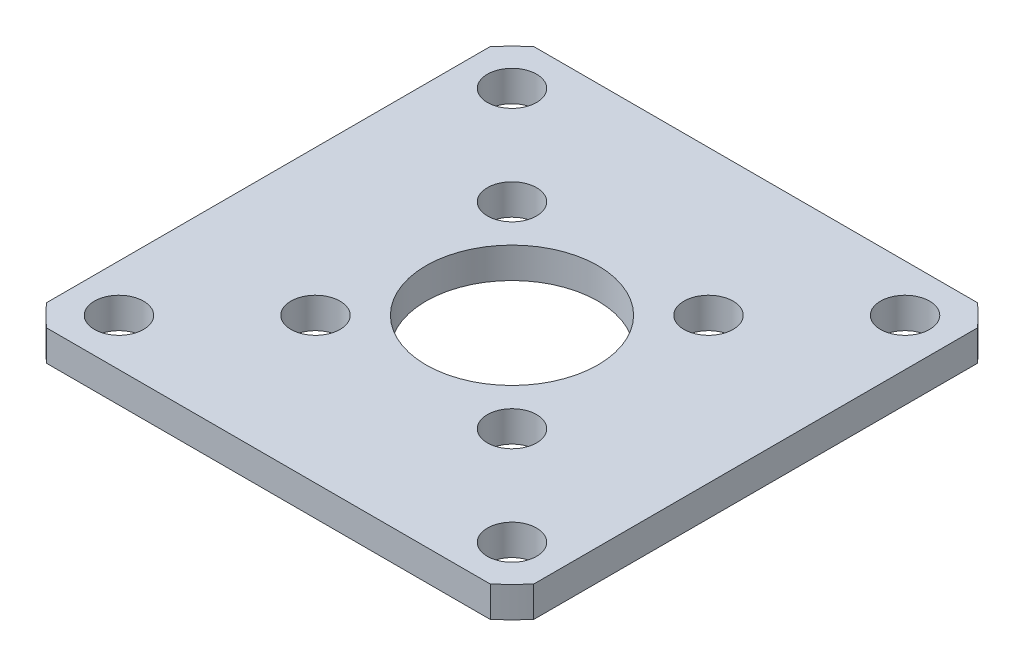
ISO-10303-21;
HEADER;
FILE_DESCRIPTION(('STEP AP214'),'2;1');
FILE_NAME('part.step','',(''),(''),'','','');
FILE_SCHEMA(('AUTOMOTIVE_DESIGN { 1 0 10303 214 1 1 1 1 }'));
ENDSEC;
DATA;
#1=APPLICATION_CONTEXT('core data for automotive mechanical design processes');
#2=APPLICATION_PROTOCOL_DEFINITION('international standard','automotive_design',2000,#1);
#3=PRODUCT_CONTEXT('',#1,'mechanical');
#4=PRODUCT('Part','Part','',(#3));
#5=PRODUCT_RELATED_PRODUCT_CATEGORY('part','',(#4));
#6=PRODUCT_DEFINITION_FORMATION('','',#4);
#7=PRODUCT_DEFINITION_CONTEXT('part definition',#1,'design');
#8=PRODUCT_DEFINITION('design','',#6,#7);
#9=PRODUCT_DEFINITION_SHAPE('','',#8);
#10=(LENGTH_UNIT() NAMED_UNIT(*) SI_UNIT(.MILLI.,.METRE.));
#11=(NAMED_UNIT(*) PLANE_ANGLE_UNIT() SI_UNIT($,.RADIAN.));
#12=(NAMED_UNIT(*) SI_UNIT($,.STERADIAN.) SOLID_ANGLE_UNIT());
#13=UNCERTAINTY_MEASURE_WITH_UNIT(LENGTH_MEASURE(1.E-05),#10,'distance_accuracy_value','');
#14=(GEOMETRIC_REPRESENTATION_CONTEXT(3) GLOBAL_UNCERTAINTY_ASSIGNED_CONTEXT((#13)) GLOBAL_UNIT_ASSIGNED_CONTEXT((#10,
#11,#12)) REPRESENTATION_CONTEXT('',''));
#15=CARTESIAN_POINT('',(0.,0.,0.));
#16=DIRECTION('',(0.,0.,1.));
#17=DIRECTION('',(1.,0.,0.));
#18=AXIS2_PLACEMENT_3D('',#15,#16,#17);
#19=CARTESIAN_POINT('',(0.,2.5,0.));
#20=DIRECTION('',(0.,-1.,0.));
#21=DIRECTION('',(0.,0.,-1.));
#22=AXIS2_PLACEMENT_3D('',#19,#20,#21);
#23=CYLINDRICAL_SURFACE('',#22,26.83);
#24=CARTESIAN_POINT('',(0.,2.5,0.));
#25=DIRECTION('',(0.,1.,0.));
#26=DIRECTION('',(0.,0.,1.));
#27=AXIS2_PLACEMENT_3D('',#24,#25,#26);
#28=CIRCLE('',#27,26.83);
#29=CARTESIAN_POINT('',(-19.8339359945665,2.5,18.0683115692485));
#30=VERTEX_POINT('',#29);
#31=CARTESIAN_POINT('',(-18.0683115692485,2.5,19.8339359945665));
#32=VERTEX_POINT('',#31);
#33=EDGE_CURVE('E117',#30,#32,#28,.T.);
#34=ORIENTED_EDGE('',*,*,#33,.F.);
#35=DIRECTION('',(0.,1.,0.));
#36=VECTOR('',#35,1.);
#37=CARTESIAN_POINT('',(-19.8339359945665,-7.5,18.0683115692485));
#38=LINE('',#37,#36);
#39=CARTESIAN_POINT('',(-19.8339359945665,0.,18.0683115692485));
#40=VERTEX_POINT('',#39);
#41=EDGE_CURVE('E101',#40,#30,#38,.T.);
#42=ORIENTED_EDGE('',*,*,#41,.F.);
#43=CARTESIAN_POINT('',(0.,0.,0.));
#44=DIRECTION('',(0.,1.,0.));
#45=DIRECTION('',(0.,0.,1.));
#46=AXIS2_PLACEMENT_3D('',#43,#44,#45);
#47=CIRCLE('',#46,26.83);
#48=CARTESIAN_POINT('',(-18.0683115692485,0.,19.8339359945665));
#49=VERTEX_POINT('',#48);
#50=EDGE_CURVE('E233',#40,#49,#47,.T.);
#51=ORIENTED_EDGE('',*,*,#50,.T.);
#52=DIRECTION('',(0.,1.,0.));
#53=VECTOR('',#52,1.);
#54=CARTESIAN_POINT('',(-18.0683115692485,-7.5,19.8339359945665));
#55=LINE('',#54,#53);
#56=EDGE_CURVE('E54',#49,#32,#55,.T.);
#57=ORIENTED_EDGE('',*,*,#56,.T.);
#58=EDGE_LOOP('',(#34,#42,#51,#57));
#59=FACE_BOUND('',#58,.T.);
#60=ADVANCED_FACE('F38',(#59),#23,.T.);
#61=CARTESIAN_POINT('',(-18.0683115692485,0.,-19.8339359945665));
#62=VERTEX_POINT('',#61);
#63=CARTESIAN_POINT('',(-19.8339359945665,0.,-18.0683115692485));
#64=VERTEX_POINT('',#63);
#65=EDGE_CURVE('E238',#62,#64,#47,.T.);
#66=ORIENTED_EDGE('',*,*,#65,.T.);
#67=DIRECTION('',(0.,1.,0.));
#68=VECTOR('',#67,1.);
#69=CARTESIAN_POINT('',(-19.8339359945665,-7.5,-18.0683115692485));
#70=LINE('',#69,#68);
#71=CARTESIAN_POINT('',(-19.8339359945665,2.5,-18.0683115692485));
#72=VERTEX_POINT('',#71);
#73=EDGE_CURVE('E62',#64,#72,#70,.T.);
#74=ORIENTED_EDGE('',*,*,#73,.T.);
#75=CARTESIAN_POINT('',(-18.0683115692485,2.5,-19.8339359945665));
#76=VERTEX_POINT('',#75);
#77=EDGE_CURVE('E120',#76,#72,#28,.T.);
#78=ORIENTED_EDGE('',*,*,#77,.F.);
#79=DIRECTION('',(0.,1.,0.));
#80=VECTOR('',#79,1.);
#81=CARTESIAN_POINT('',(-18.0683115692485,-7.5,-19.8339359945665));
#82=LINE('',#81,#80);
#83=EDGE_CURVE('E159',#62,#76,#82,.T.);
#84=ORIENTED_EDGE('',*,*,#83,.F.);
#85=EDGE_LOOP('',(#66,#74,#78,#84));
#86=FACE_BOUND('',#85,.T.);
#87=ADVANCED_FACE('F272',(#86),#23,.T.);
#88=DIRECTION('',(0.,1.,0.));
#89=VECTOR('',#88,1.);
#90=CARTESIAN_POINT('',(19.8339359945665,-7.5,18.0683115692485));
#91=LINE('',#90,#89);
#92=CARTESIAN_POINT('',(19.8339359945665,0.,18.0683115692485));
#93=VERTEX_POINT('',#92);
#94=CARTESIAN_POINT('',(19.8339359945665,2.5,18.0683115692485));
#95=VERTEX_POINT('',#94);
#96=EDGE_CURVE('E167',#93,#95,#91,.T.);
#97=ORIENTED_EDGE('',*,*,#96,.T.);
#98=CARTESIAN_POINT('',(18.0683115692485,2.5,19.8339359945665));
#99=VERTEX_POINT('',#98);
#100=EDGE_CURVE('E127',#99,#95,#28,.T.);
#101=ORIENTED_EDGE('',*,*,#100,.F.);
#102=DIRECTION('',(0.,1.,0.));
#103=VECTOR('',#102,1.);
#104=CARTESIAN_POINT('',(18.0683115692485,-7.5,19.8339359945665));
#105=LINE('',#104,#103);
#106=CARTESIAN_POINT('',(18.0683115692485,0.,19.8339359945665));
#107=VERTEX_POINT('',#106);
#108=EDGE_CURVE('E168',#107,#99,#105,.T.);
#109=ORIENTED_EDGE('',*,*,#108,.F.);
#110=EDGE_CURVE('E203',#107,#93,#47,.T.);
#111=ORIENTED_EDGE('',*,*,#110,.T.);
#112=EDGE_LOOP('',(#97,#101,#109,#111));
#113=FACE_BOUND('',#112,.T.);
#114=ADVANCED_FACE('F304',(#113),#23,.T.);
#115=CARTESIAN_POINT('',(19.8339359945665,0.,-18.0683115692485));
#116=VERTEX_POINT('',#115);
#117=CARTESIAN_POINT('',(18.0683115692485,0.,-19.8339359945665));
#118=VERTEX_POINT('',#117);
#119=EDGE_CURVE('E155',#116,#118,#47,.T.);
#120=ORIENTED_EDGE('',*,*,#119,.T.);
#121=DIRECTION('',(0.,1.,0.));
#122=VECTOR('',#121,1.);
#123=CARTESIAN_POINT('',(18.0683115692485,-7.5,-19.8339359945665));
#124=LINE('',#123,#122);
#125=CARTESIAN_POINT('',(18.0683115692485,2.5,-19.8339359945665));
#126=VERTEX_POINT('',#125);
#127=EDGE_CURVE('E122',#118,#126,#124,.T.);
#128=ORIENTED_EDGE('',*,*,#127,.T.);
#129=CARTESIAN_POINT('',(19.8339359945665,2.5,-18.0683115692485));
#130=VERTEX_POINT('',#129);
#131=EDGE_CURVE('E130',#130,#126,#28,.T.);
#132=ORIENTED_EDGE('',*,*,#131,.F.);
#133=DIRECTION('',(0.,1.,0.));
#134=VECTOR('',#133,1.);
#135=CARTESIAN_POINT('',(19.8339359945665,-7.5,-18.0683115692485));
#136=LINE('',#135,#134);
#137=EDGE_CURVE('E153',#116,#130,#136,.T.);
#138=ORIENTED_EDGE('',*,*,#137,.F.);
#139=EDGE_LOOP('',(#120,#128,#132,#138));
#140=FACE_BOUND('',#139,.T.);
#141=ADVANCED_FACE('F152',(#140),#23,.T.);
#142=CARTESIAN_POINT('',(0.,2.5,0.));
#143=DIRECTION('',(0.,1.,0.));
#144=DIRECTION('',(0.,0.,1.));
#145=AXIS2_PLACEMENT_3D('',#142,#143,#144);
#146=PLANE('',#145);
#147=DIRECTION('',(0.,0.,-1.));
#148=VECTOR('',#147,1.);
#149=CARTESIAN_POINT('',(-19.8339359945665,2.5,0.));
#150=LINE('',#149,#148);
#151=EDGE_CURVE('E104',#30,#72,#150,.T.);
#152=ORIENTED_EDGE('',*,*,#151,.F.);
#153=ORIENTED_EDGE('',*,*,#33,.T.);
#154=DIRECTION('',(1.,0.,0.));
#155=VECTOR('',#154,1.);
#156=CARTESIAN_POINT('',(0.,2.5,19.8339359945665));
#157=LINE('',#156,#155);
#158=EDGE_CURVE('E174',#32,#99,#157,.T.);
#159=ORIENTED_EDGE('',*,*,#158,.T.);
#160=ORIENTED_EDGE('',*,*,#100,.T.);
#161=DIRECTION('',(0.,0.,-1.));
#162=VECTOR('',#161,1.);
#163=CARTESIAN_POINT('',(19.8339359945665,2.5,0.));
#164=LINE('',#163,#162);
#165=EDGE_CURVE('E147',#95,#130,#164,.T.);
#166=ORIENTED_EDGE('',*,*,#165,.T.);
#167=ORIENTED_EDGE('',*,*,#131,.T.);
#168=DIRECTION('',(1.,0.,0.));
#169=VECTOR('',#168,1.);
#170=CARTESIAN_POINT('',(0.,2.5,-19.8339359945665));
#171=LINE('',#170,#169);
#172=EDGE_CURVE('E146',#76,#126,#171,.T.);
#173=ORIENTED_EDGE('',*,*,#172,.F.);
#174=ORIENTED_EDGE('',*,*,#77,.T.);
#175=EDGE_LOOP('',(#152,#153,#159,#160,#166,#167,#173,#174));
#176=FACE_BOUND('',#175,.T.);
#177=CARTESIAN_POINT('',(8.00000000071788,2.5,-8.00000000071788));
#178=DIRECTION('',(0.,1.,0.));
#179=DIRECTION('',(0.,0.,1.));
#180=AXIS2_PLACEMENT_3D('',#177,#178,#179);
#181=CIRCLE('',#180,2.);
#182=CARTESIAN_POINT('',(8.00000000071788,2.5,-6.00000000071788));
#183=VERTEX_POINT('',#182);
#184=EDGE_CURVE('E186',#183,#183,#181,.T.);
#185=ORIENTED_EDGE('',*,*,#184,.F.);
#186=EDGE_LOOP('',(#185));
#187=FACE_BOUND('',#186,.T.);
#188=CARTESIAN_POINT('',(-8.00000000071788,2.5,8.00000000071788));
#189=DIRECTION('',(0.,1.,0.));
#190=DIRECTION('',(0.,0.,1.));
#191=AXIS2_PLACEMENT_3D('',#188,#189,#190);
#192=CIRCLE('',#191,2.);
#193=CARTESIAN_POINT('',(-8.00000000071788,2.5,10.0000000007179));
#194=VERTEX_POINT('',#193);
#195=EDGE_CURVE('E185',#194,#194,#192,.T.);
#196=ORIENTED_EDGE('',*,*,#195,.F.);
#197=EDGE_LOOP('',(#196));
#198=FACE_BOUND('',#197,.T.);
#199=CARTESIAN_POINT('',(8.00000000071788,2.5,8.00000000071788));
#200=DIRECTION('',(0.,1.,0.));
#201=DIRECTION('',(0.,0.,1.));
#202=AXIS2_PLACEMENT_3D('',#199,#200,#201);
#203=CIRCLE('',#202,2.);
#204=CARTESIAN_POINT('',(8.00000000071788,2.5,10.0000000007179));
#205=VERTEX_POINT('',#204);
#206=EDGE_CURVE('E181',#205,#205,#203,.T.);
#207=ORIENTED_EDGE('',*,*,#206,.F.);
#208=EDGE_LOOP('',(#207));
#209=FACE_BOUND('',#208,.T.);
#210=CARTESIAN_POINT('',(-8.00000000071788,2.5,-8.00000000071788));
#211=DIRECTION('',(0.,1.,0.));
#212=DIRECTION('',(0.,0.,1.));
#213=AXIS2_PLACEMENT_3D('',#210,#211,#212);
#214=CIRCLE('',#213,2.);
#215=CARTESIAN_POINT('',(-8.00000000071788,2.5,-6.00000000071788));
#216=VERTEX_POINT('',#215);
#217=EDGE_CURVE('E190',#216,#216,#214,.T.);
#218=ORIENTED_EDGE('',*,*,#217,.F.);
#219=EDGE_LOOP('',(#218));
#220=FACE_BOUND('',#219,.T.);
#221=CARTESIAN_POINT('',(-16.0000000014358,2.5,16.0000000014358));
#222=DIRECTION('',(0.,1.,0.));
#223=DIRECTION('',(0.,0.,1.));
#224=AXIS2_PLACEMENT_3D('',#221,#222,#223);
#225=CIRCLE('',#224,2.);
#226=CARTESIAN_POINT('',(-16.0000000014358,2.5,18.0000000014358));
#227=VERTEX_POINT('',#226);
#228=EDGE_CURVE('E198',#227,#227,#225,.T.);
#229=ORIENTED_EDGE('',*,*,#228,.F.);
#230=EDGE_LOOP('',(#229));
#231=FACE_BOUND('',#230,.T.);
#232=CARTESIAN_POINT('',(16.0000000014358,2.5,-16.0000000014358));
#233=DIRECTION('',(0.,1.,0.));
#234=DIRECTION('',(0.,0.,1.));
#235=AXIS2_PLACEMENT_3D('',#232,#233,#234);
#236=CIRCLE('',#235,2.);
#237=CARTESIAN_POINT('',(16.0000000014358,2.5,-14.0000000014358));
#238=VERTEX_POINT('',#237);
#239=EDGE_CURVE('E202',#238,#238,#236,.T.);
#240=ORIENTED_EDGE('',*,*,#239,.F.);
#241=EDGE_LOOP('',(#240));
#242=FACE_BOUND('',#241,.T.);
#243=CARTESIAN_POINT('',(16.0000000014358,2.5,16.0000000014358));
#244=DIRECTION('',(0.,1.,0.));
#245=DIRECTION('',(0.,0.,1.));
#246=AXIS2_PLACEMENT_3D('',#243,#244,#245);
#247=CIRCLE('',#246,2.);
#248=CARTESIAN_POINT('',(16.0000000014358,2.5,18.0000000014358));
#249=VERTEX_POINT('',#248);
#250=EDGE_CURVE('E207',#249,#249,#247,.T.);
#251=ORIENTED_EDGE('',*,*,#250,.F.);
#252=EDGE_LOOP('',(#251));
#253=FACE_BOUND('',#252,.T.);
#254=CARTESIAN_POINT('',(-16.0000000014358,2.5,-16.0000000014358));
#255=DIRECTION('',(0.,1.,0.));
#256=DIRECTION('',(0.,0.,1.));
#257=AXIS2_PLACEMENT_3D('',#254,#255,#256);
#258=CIRCLE('',#257,2.);
#259=CARTESIAN_POINT('',(-16.0000000014358,2.5,-14.0000000014358));
#260=VERTEX_POINT('',#259);
#261=EDGE_CURVE('E132',#260,#260,#258,.T.);
#262=ORIENTED_EDGE('',*,*,#261,.F.);
#263=EDGE_LOOP('',(#262));
#264=FACE_BOUND('',#263,.T.);
#265=CARTESIAN_POINT('',(0.,2.5,0.));
#266=DIRECTION('',(0.,1.,0.));
#267=DIRECTION('',(0.,0.,1.));
#268=AXIS2_PLACEMENT_3D('',#265,#266,#267);
#269=CIRCLE('',#268,7.00000000000001);
#270=CARTESIAN_POINT('',(0.,2.5,7.00000000000001));
#271=VERTEX_POINT('',#270);
#272=EDGE_CURVE('E125',#271,#271,#269,.T.);
#273=ORIENTED_EDGE('',*,*,#272,.F.);
#274=EDGE_LOOP('',(#273));
#275=FACE_BOUND('',#274,.T.);
#276=ADVANCED_FACE('F114',(#176,#187,#198,#209,#220,#231,#242,#253,#264,#275),#146,.T.);
#277=CARTESIAN_POINT('',(0.,0.,0.));
#278=DIRECTION('',(0.,1.,0.));
#279=DIRECTION('',(0.,0.,1.));
#280=AXIS2_PLACEMENT_3D('',#277,#278,#279);
#281=PLANE('',#280);
#282=CARTESIAN_POINT('',(8.00000000071788,0.,-8.00000000071788));
#283=DIRECTION('',(0.,1.,0.));
#284=DIRECTION('',(0.,0.,1.));
#285=AXIS2_PLACEMENT_3D('',#282,#283,#284);
#286=CIRCLE('',#285,2.);
#287=CARTESIAN_POINT('',(8.00000000071788,0.,-6.00000000071788));
#288=VERTEX_POINT('',#287);
#289=EDGE_CURVE('E258',#288,#288,#286,.T.);
#290=ORIENTED_EDGE('',*,*,#289,.T.);
#291=EDGE_LOOP('',(#290));
#292=FACE_BOUND('',#291,.T.);
#293=CARTESIAN_POINT('',(-8.00000000071788,0.,8.00000000071788));
#294=DIRECTION('',(0.,1.,0.));
#295=DIRECTION('',(0.,0.,1.));
#296=AXIS2_PLACEMENT_3D('',#293,#294,#295);
#297=CIRCLE('',#296,2.);
#298=CARTESIAN_POINT('',(-8.00000000071788,0.,10.0000000007179));
#299=VERTEX_POINT('',#298);
#300=EDGE_CURVE('E254',#299,#299,#297,.T.);
#301=ORIENTED_EDGE('',*,*,#300,.T.);
#302=EDGE_LOOP('',(#301));
#303=FACE_BOUND('',#302,.T.);
#304=CARTESIAN_POINT('',(8.00000000071788,0.,8.00000000071788));
#305=DIRECTION('',(0.,1.,0.));
#306=DIRECTION('',(0.,0.,1.));
#307=AXIS2_PLACEMENT_3D('',#304,#305,#306);
#308=CIRCLE('',#307,2.);
#309=CARTESIAN_POINT('',(8.00000000071788,0.,10.0000000007179));
#310=VERTEX_POINT('',#309);
#311=EDGE_CURVE('E250',#310,#310,#308,.T.);
#312=ORIENTED_EDGE('',*,*,#311,.T.);
#313=EDGE_LOOP('',(#312));
#314=FACE_BOUND('',#313,.T.);
#315=CARTESIAN_POINT('',(-8.00000000071788,0.,-8.00000000071788));
#316=DIRECTION('',(0.,1.,0.));
#317=DIRECTION('',(0.,0.,1.));
#318=AXIS2_PLACEMENT_3D('',#315,#316,#317);
#319=CIRCLE('',#318,2.);
#320=CARTESIAN_POINT('',(-8.00000000071788,0.,-6.00000000071788));
#321=VERTEX_POINT('',#320);
#322=EDGE_CURVE('E197',#321,#321,#319,.T.);
#323=ORIENTED_EDGE('',*,*,#322,.T.);
#324=EDGE_LOOP('',(#323));
#325=FACE_BOUND('',#324,.T.);
#326=CARTESIAN_POINT('',(-16.0000000014358,0.,16.0000000014358));
#327=DIRECTION('',(0.,1.,0.));
#328=DIRECTION('',(0.,0.,1.));
#329=AXIS2_PLACEMENT_3D('',#326,#327,#328);
#330=CIRCLE('',#329,2.);
#331=CARTESIAN_POINT('',(-16.0000000014358,0.,18.0000000014358));
#332=VERTEX_POINT('',#331);
#333=EDGE_CURVE('E261',#332,#332,#330,.T.);
#334=ORIENTED_EDGE('',*,*,#333,.T.);
#335=EDGE_LOOP('',(#334));
#336=FACE_BOUND('',#335,.T.);
#337=CARTESIAN_POINT('',(16.0000000014358,0.,-16.0000000014358));
#338=DIRECTION('',(0.,1.,0.));
#339=DIRECTION('',(0.,0.,1.));
#340=AXIS2_PLACEMENT_3D('',#337,#338,#339);
#341=CIRCLE('',#340,2.);
#342=CARTESIAN_POINT('',(16.0000000014358,0.,-14.0000000014358));
#343=VERTEX_POINT('',#342);
#344=EDGE_CURVE('E278',#343,#343,#341,.T.);
#345=ORIENTED_EDGE('',*,*,#344,.T.);
#346=EDGE_LOOP('',(#345));
#347=FACE_BOUND('',#346,.T.);
#348=CARTESIAN_POINT('',(16.0000000014358,0.,16.0000000014358));
#349=DIRECTION('',(0.,1.,0.));
#350=DIRECTION('',(0.,0.,1.));
#351=AXIS2_PLACEMENT_3D('',#348,#349,#350);
#352=CIRCLE('',#351,2.);
#353=CARTESIAN_POINT('',(16.0000000014358,0.,18.0000000014358));
#354=VERTEX_POINT('',#353);
#355=EDGE_CURVE('E241',#354,#354,#352,.T.);
#356=ORIENTED_EDGE('',*,*,#355,.T.);
#357=EDGE_LOOP('',(#356));
#358=FACE_BOUND('',#357,.T.);
#359=CARTESIAN_POINT('',(-16.0000000014358,0.,-16.0000000014358));
#360=DIRECTION('',(0.,1.,0.));
#361=DIRECTION('',(0.,0.,1.));
#362=AXIS2_PLACEMENT_3D('',#359,#360,#361);
#363=CIRCLE('',#362,2.);
#364=CARTESIAN_POINT('',(-16.0000000014358,0.,-14.0000000014358));
#365=VERTEX_POINT('',#364);
#366=EDGE_CURVE('E234',#365,#365,#363,.T.);
#367=ORIENTED_EDGE('',*,*,#366,.T.);
#368=EDGE_LOOP('',(#367));
#369=FACE_BOUND('',#368,.T.);
#370=CARTESIAN_POINT('',(0.,0.,0.));
#371=DIRECTION('',(0.,1.,0.));
#372=DIRECTION('',(0.,0.,1.));
#373=AXIS2_PLACEMENT_3D('',#370,#371,#372);
#374=CIRCLE('',#373,7.00000000000001);
#375=CARTESIAN_POINT('',(0.,0.,7.00000000000001));
#376=VERTEX_POINT('',#375);
#377=EDGE_CURVE('E230',#376,#376,#374,.T.);
#378=ORIENTED_EDGE('',*,*,#377,.T.);
#379=EDGE_LOOP('',(#378));
#380=FACE_BOUND('',#379,.T.);
#381=ORIENTED_EDGE('',*,*,#50,.F.);
#382=DIRECTION('',(0.,0.,-1.));
#383=VECTOR('',#382,1.);
#384=CARTESIAN_POINT('',(-19.8339359945665,0.,0.));
#385=LINE('',#384,#383);
#386=EDGE_CURVE('E11',#40,#64,#385,.T.);
#387=ORIENTED_EDGE('',*,*,#386,.T.);
#388=ORIENTED_EDGE('',*,*,#65,.F.);
#389=DIRECTION('',(1.,0.,0.));
#390=VECTOR('',#389,1.);
#391=CARTESIAN_POINT('',(0.,0.,-19.8339359945665));
#392=LINE('',#391,#390);
#393=EDGE_CURVE('E47',#62,#118,#392,.T.);
#394=ORIENTED_EDGE('',*,*,#393,.T.);
#395=ORIENTED_EDGE('',*,*,#119,.F.);
#396=DIRECTION('',(0.,0.,-1.));
#397=VECTOR('',#396,1.);
#398=CARTESIAN_POINT('',(19.8339359945665,0.,0.));
#399=LINE('',#398,#397);
#400=EDGE_CURVE('E142',#93,#116,#399,.T.);
#401=ORIENTED_EDGE('',*,*,#400,.F.);
#402=ORIENTED_EDGE('',*,*,#110,.F.);
#403=DIRECTION('',(1.,0.,0.));
#404=VECTOR('',#403,1.);
#405=CARTESIAN_POINT('',(0.,0.,19.8339359945665));
#406=LINE('',#405,#404);
#407=EDGE_CURVE('E137',#49,#107,#406,.T.);
#408=ORIENTED_EDGE('',*,*,#407,.F.);
#409=EDGE_LOOP('',(#381,#387,#388,#394,#395,#401,#402,#408));
#410=FACE_BOUND('',#409,.T.);
#411=ADVANCED_FACE('F220',(#292,#303,#314,#325,#336,#347,#358,#369,#380,#410),#281,.F.);
#412=CARTESIAN_POINT('',(0.,2.5,0.));
#413=DIRECTION('',(0.,-1.,0.));
#414=DIRECTION('',(0.,0.,-1.));
#415=AXIS2_PLACEMENT_3D('',#412,#413,#414);
#416=CYLINDRICAL_SURFACE('',#415,7.00000000000001);
#417=ORIENTED_EDGE('',*,*,#272,.T.);
#418=EDGE_LOOP('',(#417));
#419=FACE_BOUND('',#418,.T.);
#420=ORIENTED_EDGE('',*,*,#377,.F.);
#421=EDGE_LOOP('',(#420));
#422=FACE_BOUND('',#421,.T.);
#423=ADVANCED_FACE('F224',(#419,#422),#416,.F.);
#424=CARTESIAN_POINT('',(-16.0000000014358,2.5,-16.0000000014358));
#425=DIRECTION('',(0.,-1.,0.));
#426=DIRECTION('',(0.,0.,-1.));
#427=AXIS2_PLACEMENT_3D('',#424,#425,#426);
#428=CYLINDRICAL_SURFACE('',#427,2.);
#429=ORIENTED_EDGE('',*,*,#261,.T.);
#430=EDGE_LOOP('',(#429));
#431=FACE_BOUND('',#430,.T.);
#432=ORIENTED_EDGE('',*,*,#366,.F.);
#433=EDGE_LOOP('',(#432));
#434=FACE_BOUND('',#433,.T.);
#435=ADVANCED_FACE('F215',(#431,#434),#428,.F.);
#436=CARTESIAN_POINT('',(16.0000000014358,2.5,16.0000000014358));
#437=DIRECTION('',(0.,-1.,0.));
#438=DIRECTION('',(0.,0.,-1.));
#439=AXIS2_PLACEMENT_3D('',#436,#437,#438);
#440=CYLINDRICAL_SURFACE('',#439,2.);
#441=ORIENTED_EDGE('',*,*,#250,.T.);
#442=EDGE_LOOP('',(#441));
#443=FACE_BOUND('',#442,.T.);
#444=ORIENTED_EDGE('',*,*,#355,.F.);
#445=EDGE_LOOP('',(#444));
#446=FACE_BOUND('',#445,.T.);
#447=ADVANCED_FACE('F287',(#443,#446),#440,.F.);
#448=CARTESIAN_POINT('',(16.0000000014358,2.5,-16.0000000014358));
#449=DIRECTION('',(0.,-1.,0.));
#450=DIRECTION('',(0.,0.,-1.));
#451=AXIS2_PLACEMENT_3D('',#448,#449,#450);
#452=CYLINDRICAL_SURFACE('',#451,2.);
#453=ORIENTED_EDGE('',*,*,#239,.T.);
#454=EDGE_LOOP('',(#453));
#455=FACE_BOUND('',#454,.T.);
#456=ORIENTED_EDGE('',*,*,#344,.F.);
#457=EDGE_LOOP('',(#456));
#458=FACE_BOUND('',#457,.T.);
#459=ADVANCED_FACE('F289',(#455,#458),#452,.F.);
#460=CARTESIAN_POINT('',(-16.0000000014358,2.5,16.0000000014358));
#461=DIRECTION('',(0.,-1.,0.));
#462=DIRECTION('',(0.,0.,-1.));
#463=AXIS2_PLACEMENT_3D('',#460,#461,#462);
#464=CYLINDRICAL_SURFACE('',#463,2.);
#465=ORIENTED_EDGE('',*,*,#228,.T.);
#466=EDGE_LOOP('',(#465));
#467=FACE_BOUND('',#466,.T.);
#468=ORIENTED_EDGE('',*,*,#333,.F.);
#469=EDGE_LOOP('',(#468));
#470=FACE_BOUND('',#469,.T.);
#471=ADVANCED_FACE('F40',(#467,#470),#464,.F.);
#472=CARTESIAN_POINT('',(-8.00000000071788,-7.5,-8.00000000071788));
#473=DIRECTION('',(0.,1.,0.));
#474=DIRECTION('',(0.,0.,1.));
#475=AXIS2_PLACEMENT_3D('',#472,#473,#474);
#476=CYLINDRICAL_SURFACE('',#475,2.);
#477=ORIENTED_EDGE('',*,*,#217,.T.);
#478=EDGE_LOOP('',(#477));
#479=FACE_BOUND('',#478,.T.);
#480=ORIENTED_EDGE('',*,*,#322,.F.);
#481=EDGE_LOOP('',(#480));
#482=FACE_BOUND('',#481,.T.);
#483=ADVANCED_FACE('F333',(#479,#482),#476,.F.);
#484=CARTESIAN_POINT('',(8.00000000071788,-7.5,8.00000000071788));
#485=DIRECTION('',(0.,1.,0.));
#486=DIRECTION('',(0.,0.,1.));
#487=AXIS2_PLACEMENT_3D('',#484,#485,#486);
#488=CYLINDRICAL_SURFACE('',#487,2.);
#489=ORIENTED_EDGE('',*,*,#206,.T.);
#490=EDGE_LOOP('',(#489));
#491=FACE_BOUND('',#490,.T.);
#492=ORIENTED_EDGE('',*,*,#311,.F.);
#493=EDGE_LOOP('',(#492));
#494=FACE_BOUND('',#493,.T.);
#495=ADVANCED_FACE('F331',(#491,#494),#488,.F.);
#496=CARTESIAN_POINT('',(-8.00000000071788,-7.5,8.00000000071788));
#497=DIRECTION('',(0.,1.,0.));
#498=DIRECTION('',(0.,0.,1.));
#499=AXIS2_PLACEMENT_3D('',#496,#497,#498);
#500=CYLINDRICAL_SURFACE('',#499,2.);
#501=ORIENTED_EDGE('',*,*,#195,.T.);
#502=EDGE_LOOP('',(#501));
#503=FACE_BOUND('',#502,.T.);
#504=ORIENTED_EDGE('',*,*,#300,.F.);
#505=EDGE_LOOP('',(#504));
#506=FACE_BOUND('',#505,.T.);
#507=ADVANCED_FACE('F326',(#503,#506),#500,.F.);
#508=CARTESIAN_POINT('',(8.00000000071788,-7.5,-8.00000000071788));
#509=DIRECTION('',(0.,1.,0.));
#510=DIRECTION('',(0.,0.,1.));
#511=AXIS2_PLACEMENT_3D('',#508,#509,#510);
#512=CYLINDRICAL_SURFACE('',#511,2.);
#513=ORIENTED_EDGE('',*,*,#184,.T.);
#514=EDGE_LOOP('',(#513));
#515=FACE_BOUND('',#514,.T.);
#516=ORIENTED_EDGE('',*,*,#289,.F.);
#517=EDGE_LOOP('',(#516));
#518=FACE_BOUND('',#517,.T.);
#519=ADVANCED_FACE('F319',(#515,#518),#512,.F.);
#520=CARTESIAN_POINT('',(0.,-7.5,19.8339359945665));
#521=DIRECTION('',(0.,0.,1.));
#522=DIRECTION('',(1.,0.,0.));
#523=AXIS2_PLACEMENT_3D('',#520,#521,#522);
#524=PLANE('',#523);
#525=ORIENTED_EDGE('',*,*,#407,.T.);
#526=ORIENTED_EDGE('',*,*,#108,.T.);
#527=ORIENTED_EDGE('',*,*,#158,.F.);
#528=ORIENTED_EDGE('',*,*,#56,.F.);
#529=EDGE_LOOP('',(#525,#526,#527,#528));
#530=FACE_BOUND('',#529,.T.);
#531=ADVANCED_FACE('F317',(#530),#524,.T.);
#532=CARTESIAN_POINT('',(19.8339359945665,-7.5,0.));
#533=DIRECTION('',(1.,0.,0.));
#534=DIRECTION('',(0.,0.,-1.));
#535=AXIS2_PLACEMENT_3D('',#532,#533,#534);
#536=PLANE('',#535);
#537=ORIENTED_EDGE('',*,*,#400,.T.);
#538=ORIENTED_EDGE('',*,*,#137,.T.);
#539=ORIENTED_EDGE('',*,*,#165,.F.);
#540=ORIENTED_EDGE('',*,*,#96,.F.);
#541=EDGE_LOOP('',(#537,#538,#539,#540));
#542=FACE_BOUND('',#541,.T.);
#543=ADVANCED_FACE('F316',(#542),#536,.T.);
#544=CARTESIAN_POINT('',(0.,-7.5,-19.8339359945665));
#545=DIRECTION('',(0.,0.,1.));
#546=DIRECTION('',(1.,0.,0.));
#547=AXIS2_PLACEMENT_3D('',#544,#545,#546);
#548=PLANE('',#547);
#549=ORIENTED_EDGE('',*,*,#83,.T.);
#550=ORIENTED_EDGE('',*,*,#172,.T.);
#551=ORIENTED_EDGE('',*,*,#127,.F.);
#552=ORIENTED_EDGE('',*,*,#393,.F.);
#553=EDGE_LOOP('',(#549,#550,#551,#552));
#554=FACE_BOUND('',#553,.T.);
#555=ADVANCED_FACE('F270',(#554),#548,.F.);
#556=CARTESIAN_POINT('',(-19.8339359945665,-7.5,0.));
#557=DIRECTION('',(1.,0.,0.));
#558=DIRECTION('',(0.,0.,-1.));
#559=AXIS2_PLACEMENT_3D('',#556,#557,#558);
#560=PLANE('',#559);
#561=ORIENTED_EDGE('',*,*,#41,.T.);
#562=ORIENTED_EDGE('',*,*,#151,.T.);
#563=ORIENTED_EDGE('',*,*,#73,.F.);
#564=ORIENTED_EDGE('',*,*,#386,.F.);
#565=EDGE_LOOP('',(#561,#562,#563,#564));
#566=FACE_BOUND('',#565,.T.);
#567=ADVANCED_FACE('F103',(#566),#560,.F.);
#568=CLOSED_SHELL('',(#60,#87,#114,#141,#276,#411,#423,#435,#447,#459,#471,#483,#495,#507,#519,
#531,#543,#555,#567));
#569=MANIFOLD_SOLID_BREP('B2',#568);
#570=ADVANCED_BREP_SHAPE_REPRESENTATION('',(#18,#569),#14);
#571=SHAPE_DEFINITION_REPRESENTATION(#9,#570);
ENDSEC;
END-ISO-10303-21;
